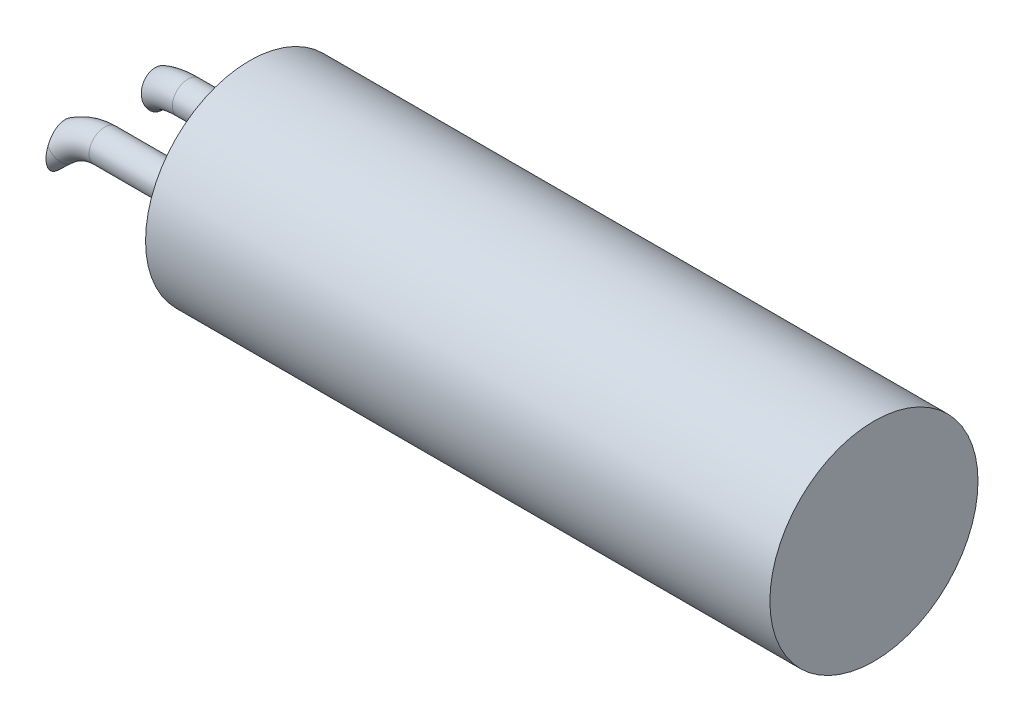
ISO-10303-21;
HEADER;
FILE_DESCRIPTION(('STEP AP214'),'2;1');
FILE_NAME('part.step','',(''),(''),'','','');
FILE_SCHEMA(('AUTOMOTIVE_DESIGN { 1 0 10303 214 1 1 1 1 }'));
ENDSEC;
DATA;
#1=APPLICATION_CONTEXT('core data for automotive mechanical design processes');
#2=APPLICATION_PROTOCOL_DEFINITION('international standard','automotive_design',2000,#1);
#3=PRODUCT_CONTEXT('',#1,'mechanical');
#4=PRODUCT('Part','Part','',(#3));
#5=PRODUCT_RELATED_PRODUCT_CATEGORY('part','',(#4));
#6=PRODUCT_DEFINITION_FORMATION('','',#4);
#7=PRODUCT_DEFINITION_CONTEXT('part definition',#1,'design');
#8=PRODUCT_DEFINITION('design','',#6,#7);
#9=PRODUCT_DEFINITION_SHAPE('','',#8);
#10=(LENGTH_UNIT() NAMED_UNIT(*) SI_UNIT(.MILLI.,.METRE.));
#11=(NAMED_UNIT(*) PLANE_ANGLE_UNIT() SI_UNIT($,.RADIAN.));
#12=(NAMED_UNIT(*) SI_UNIT($,.STERADIAN.) SOLID_ANGLE_UNIT());
#13=UNCERTAINTY_MEASURE_WITH_UNIT(LENGTH_MEASURE(1.E-05),#10,'distance_accuracy_value','');
#14=(GEOMETRIC_REPRESENTATION_CONTEXT(3) GLOBAL_UNCERTAINTY_ASSIGNED_CONTEXT((#13)) GLOBAL_UNIT_ASSIGNED_CONTEXT((#10,
#11,#12)) REPRESENTATION_CONTEXT('',''));
#15=CARTESIAN_POINT('',(0.,0.,0.));
#16=DIRECTION('',(0.,0.,1.));
#17=DIRECTION('',(1.,0.,0.));
#18=AXIS2_PLACEMENT_3D('',#15,#16,#17);
#19=CARTESIAN_POINT('',(-2.,5.9423211219704,-1.50030921711147));
#20=DIRECTION('',(-1.,0.,0.));
#21=DIRECTION('',(0.,-1.,0.));
#22=AXIS2_PLACEMENT_3D('',#19,#20,#21);
#23=PLANE('',#22);
#24=CARTESIAN_POINT('',(-2.,1.5,0.));
#25=DIRECTION('',(-1.,0.,0.));
#26=DIRECTION('',(0.,0.,1.));
#27=AXIS2_PLACEMENT_3D('',#24,#25,#26);
#28=CIRCLE('',#27,1.);
#29=CARTESIAN_POINT('',(-2.,1.5,1.));
#30=VERTEX_POINT('',#29);
#31=EDGE_CURVE('E82',#30,#30,#28,.T.);
#32=ORIENTED_EDGE('',*,*,#31,.F.);
#33=EDGE_LOOP('',(#32));
#34=FACE_BOUND('',#33,.T.);
#35=ADVANCED_FACE('F41',(#34),#23,.F.);
#36=CARTESIAN_POINT('',(-2.,1.5,0.));
#37=DIRECTION('',(-1.,0.,0.));
#38=DIRECTION('',(0.,0.,1.));
#39=AXIS2_PLACEMENT_3D('',#36,#37,#38);
#40=CYLINDRICAL_SURFACE('',#39,1.);
#41=ORIENTED_EDGE('',*,*,#31,.T.);
#42=EDGE_LOOP('',(#41));
#43=FACE_BOUND('',#42,.T.);
#44=CARTESIAN_POINT('',(-8.,1.5,0.));
#45=DIRECTION('',(-1.,0.,0.));
#46=DIRECTION('',(0.,0.,1.));
#47=AXIS2_PLACEMENT_3D('',#44,#45,#46);
#48=CIRCLE('',#47,1.);
#49=CARTESIAN_POINT('',(-8.,1.5,1.));
#50=VERTEX_POINT('',#49);
#51=EDGE_CURVE('E157',#50,#50,#48,.T.);
#52=ORIENTED_EDGE('',*,*,#51,.F.);
#53=EDGE_LOOP('',(#52));
#54=FACE_BOUND('',#53,.T.);
#55=ADVANCED_FACE('F139',(#43,#54),#40,.T.);
#56=CARTESIAN_POINT('',(-8.,1.5,0.));
#57=DIRECTION('',(1.,0.,0.));
#58=DIRECTION('',(0.,0.,-1.));
#59=AXIS2_PLACEMENT_3D('',#56,#57,#58);
#60=PLANE('',#59);
#61=CARTESIAN_POINT('',(-8.,1.5,0.4));
#62=DIRECTION('',(1.,0.,0.));
#63=DIRECTION('',(0.,1.,0.));
#64=AXIS2_PLACEMENT_3D('',#61,#62,#63);
#65=CIRCLE('',#64,0.15);
#66=CARTESIAN_POINT('',(-8.,1.65,0.4));
#67=VERTEX_POINT('',#66);
#68=EDGE_CURVE('E103',#67,#67,#65,.F.);
#69=ORIENTED_EDGE('',*,*,#68,.F.);
#70=EDGE_LOOP('',(#69));
#71=FACE_BOUND('',#70,.T.);
#72=CARTESIAN_POINT('',(-8.,1.5,-0.4));
#73=DIRECTION('',(1.,0.,0.));
#74=DIRECTION('',(0.,1.,0.));
#75=AXIS2_PLACEMENT_3D('',#72,#73,#74);
#76=CIRCLE('',#75,0.15);
#77=CARTESIAN_POINT('',(-8.,1.65,-0.4));
#78=VERTEX_POINT('',#77);
#79=EDGE_CURVE('E56',#78,#78,#76,.F.);
#80=ORIENTED_EDGE('',*,*,#79,.F.);
#81=EDGE_LOOP('',(#80));
#82=FACE_BOUND('',#81,.T.);
#83=ORIENTED_EDGE('',*,*,#51,.T.);
#84=EDGE_LOOP('',(#83));
#85=FACE_BOUND('',#84,.T.);
#86=ADVANCED_FACE('F144',(#71,#82,#85),#60,.F.);
#87=CARTESIAN_POINT('',(-9.34644660940673,1.36617539706785,0.459477601303177));
#88=DIRECTION('',(-0.707106781186545,-0.646162342755967,0.287183263447096));
#89=DIRECTION('',(0.674578520096278,-0.738203102286027,0.));
#90=AXIS2_PLACEMENT_3D('',#87,#88,#89);
#91=CYLINDRICAL_SURFACE('',#90,0.15);
#92=CARTESIAN_POINT('',(-9.33865218017504,1.37329803651468,0.456311983771255));
#93=DIRECTION('',(1.,0.,0.));
#94=DIRECTION('',(0.,-0.913811548620257,0.406138466053447));
#95=AXIS2_PLACEMENT_3D('',#92,#93,#94);
#96=ELLIPSE('',#95,0.212132034355966,0.15);
#97=CARTESIAN_POINT('',(-9.33865218017504,1.29829670493927,0.325942100301139));
#98=VERTEX_POINT('',#97);
#99=CARTESIAN_POINT('',(-9.33865218017504,1.41980881030279,0.599344337369057));
#100=VERTEX_POINT('',#99);
#101=EDGE_CURVE('E62',#98,#100,#96,.F.);
#102=ORIENTED_EDGE('',*,*,#101,.F.);
#103=CARTESIAN_POINT('',(-9.34644660940673,1.36617539706785,0.459477601303177));
#104=DIRECTION('',(-0.707106781186544,-0.646162342755967,0.287183263447096));
#105=DIRECTION('',(-0.707106781186551,0.646162342755962,-0.287183263447094));
#106=AXIS2_PLACEMENT_3D('',#103,#104,#105);
#107=CIRCLE('',#106,0.15);
#108=EDGE_CURVE('E88',#100,#98,#107,.F.);
#109=ORIENTED_EDGE('',*,*,#108,.F.);
#110=EDGE_LOOP('',(#102,#109));
#111=FACE_BOUND('',#110,.T.);
#112=ADVANCED_FACE('F43',(#111),#91,.T.);
#113=CARTESIAN_POINT('',(-9.34644660940673,1.36617539706785,-0.459477601303177));
#114=DIRECTION('',(-0.707106781186545,-0.646162342755967,-0.287183263447096));
#115=DIRECTION('',(0.674578520096278,-0.738203102286027,0.));
#116=AXIS2_PLACEMENT_3D('',#113,#114,#115);
#117=CYLINDRICAL_SURFACE('',#116,0.15);
#118=CARTESIAN_POINT('',(-9.33865218017504,1.37329803651468,-0.456311983771255));
#119=DIRECTION('',(1.,0.,0.));
#120=DIRECTION('',(0.,-0.913811548620257,-0.406138466053447));
#121=AXIS2_PLACEMENT_3D('',#118,#119,#120);
#122=ELLIPSE('',#121,0.212132034355966,0.15);
#123=CARTESIAN_POINT('',(-9.33865218017504,1.41980881030279,-0.599344337369058));
#124=VERTEX_POINT('',#123);
#125=CARTESIAN_POINT('',(-9.33865218017504,1.29829670493927,-0.325942100301141));
#126=VERTEX_POINT('',#125);
#127=EDGE_CURVE('E68',#124,#126,#122,.F.);
#128=ORIENTED_EDGE('',*,*,#127,.F.);
#129=CARTESIAN_POINT('',(-9.34644660940673,1.36617539706785,-0.459477601303177));
#130=DIRECTION('',(-0.707106781186544,-0.646162342755968,-0.287183263447096));
#131=DIRECTION('',(-0.707106781186551,0.646162342755961,0.287183263447094));
#132=AXIS2_PLACEMENT_3D('',#129,#130,#131);
#133=CIRCLE('',#132,0.15);
#134=EDGE_CURVE('E79',#126,#124,#133,.F.);
#135=ORIENTED_EDGE('',*,*,#134,.F.);
#136=EDGE_LOOP('',(#128,#135));
#137=FACE_BOUND('',#136,.T.);
#138=ADVANCED_FACE('F78',(#137),#117,.T.);
#139=CARTESIAN_POINT('',(-8.99289321881345,1.04309422568987,0.603069233026724));
#140=DIRECTION('',(0.,0.406138466053447,0.913811548620257));
#141=DIRECTION('',(0.,-0.913811548620257,0.406138466053447));
#142=AXIS2_PLACEMENT_3D('',#139,#140,#141);
#143=TOROIDAL_SURFACE('',#142,0.5,0.15);
#144=CARTESIAN_POINT('',(-9.33865218017504,1.41980881030279,0.599344337369057));
#145=CARTESIAN_POINT('',(-9.33865218017504,1.43157316977731,0.594826662663784));
#146=CARTESIAN_POINT('',(-9.33865218017504,1.44307532004661,0.589583979027131));
#147=CARTESIAN_POINT('',(-9.33865218017504,1.46530271629744,0.577456800797008));
#148=CARTESIAN_POINT('',(-9.33865218017504,1.47602021043632,0.57055822573458));
#149=CARTESIAN_POINT('',(-9.33865218017504,1.50295389923014,0.549801582843309));
#150=CARTESIAN_POINT('',(-9.33865218017504,1.5180553152464,0.53437429458602));
#151=CARTESIAN_POINT('',(-9.33865218017504,1.53990345295043,0.501970769790883));
#152=CARTESIAN_POINT('',(-9.33865218017504,1.54762305064194,0.485681047238925));
#153=CARTESIAN_POINT('',(-9.33865218017504,1.55455432007595,0.459942801090929));
#154=CARTESIAN_POINT('',(-9.33865218017504,1.5560856977152,0.451096887159833));
#155=CARTESIAN_POINT('',(-9.33865218017504,1.55740423330771,0.433268717834219));
#156=CARTESIAN_POINT('',(-9.33865218017504,1.55719270008103,0.424286569801898));
#157=CARTESIAN_POINT('',(-9.33865218017504,1.55508368201065,0.407706637740336));
#158=CARTESIAN_POINT('',(-9.33865218017504,1.55340837700617,0.400080374941327));
#159=CARTESIAN_POINT('',(-9.33865218017504,1.54870155267828,0.385256386097838));
#160=CARTESIAN_POINT('',(-9.33865218017504,1.54566893322539,0.378059013049641));
#161=CARTESIAN_POINT('',(-9.33865218017504,1.53520906938629,0.358535433913348));
#162=CARTESIAN_POINT('',(-9.33865218017504,1.52623235542958,0.347001122342675));
#163=CARTESIAN_POINT('',(-9.33865218017504,1.50499683043107,0.327315001097746));
#164=CARTESIAN_POINT('',(-9.33865218017504,1.4926990810029,0.319206453425031));
#165=CARTESIAN_POINT('',(-9.33865218017504,1.46521368713066,0.30635002238565));
#166=CARTESIAN_POINT('',(-9.33865218017504,1.44986895242092,0.301948172642158));
#167=CARTESIAN_POINT('',(-9.33865218017504,1.41631621029359,0.297043179008279));
#168=CARTESIAN_POINT('',(-9.33865218017504,1.39801909387635,0.297208918234936));
#169=CARTESIAN_POINT('',(-9.33865218017504,1.3657586701094,0.30153105472961));
#170=CARTESIAN_POINT('',(-9.33865218017504,1.35166423492577,0.304877633510659));
#171=CARTESIAN_POINT('',(-9.33865218017504,1.32431335372093,0.313849841040009));
#172=CARTESIAN_POINT('',(-9.33865218017504,1.31105188847335,0.319459915859286));
#173=CARTESIAN_POINT('',(-9.33865218017504,1.29829670493927,0.325942100301138));
#174=B_SPLINE_CURVE_WITH_KNOTS('',3,(#144,#145,#146,#147,#148,#149,#150,#151,#152,#153,#154,
#155,#156,#157,#158,#159,#160,#161,#162,#163,#164,#165,#166,#167,#168,#169,#170,#171,#172,#173),
.UNSPECIFIED.,.F.,.F.,(4,2,2,2,2,2,2,2,2,2,2,2,2,2,4),(0.,0.0377915199945497,0.075916545048645,
0.139532875584499,0.192548194302011,0.219334559706417,0.246100812013921,0.269396196619837,
0.29271049687235,0.335681064187395,0.379179140361023,0.426390998538786,0.480548943259747,
0.523807790367129,0.566774307787138),.UNSPECIFIED.);
#175=EDGE_CURVE('E81',#100,#98,#174,.T.);
#176=ORIENTED_EDGE('',*,*,#175,.F.);
#177=ORIENTED_EDGE('',*,*,#108,.T.);
#178=EDGE_LOOP('',(#176,#177));
#179=FACE_BOUND('',#178,.T.);
#180=CARTESIAN_POINT('',(-8.99289321881345,1.5,0.4));
#181=DIRECTION('',(1.,0.,0.));
#182=DIRECTION('',(0.,1.,0.));
#183=AXIS2_PLACEMENT_3D('',#180,#181,#182);
#184=CIRCLE('',#183,0.15);
#185=CARTESIAN_POINT('',(-8.99289321881345,1.65,0.4));
#186=VERTEX_POINT('',#185);
#187=EDGE_CURVE('E87',#186,#186,#184,.T.);
#188=ORIENTED_EDGE('',*,*,#187,.F.);
#189=EDGE_LOOP('',(#188));
#190=FACE_BOUND('',#189,.T.);
#191=ADVANCED_FACE('F122',(#179,#190),#143,.T.);
#192=CARTESIAN_POINT('',(-8.99289321881345,1.04309422568987,-0.603069233026724));
#193=DIRECTION('',(0.,-0.406138466053447,0.913811548620257));
#194=DIRECTION('',(0.,-0.913811548620257,-0.406138466053447));
#195=AXIS2_PLACEMENT_3D('',#192,#193,#194);
#196=TOROIDAL_SURFACE('',#195,0.5,0.15);
#197=CARTESIAN_POINT('',(-9.33865218017504,1.29829670493927,-0.32594210030114));
#198=CARTESIAN_POINT('',(-9.33865218017504,1.30953336416219,-0.320237100029774));
#199=CARTESIAN_POINT('',(-9.33865218017504,1.32113246714512,-0.315212559998768));
#200=CARTESIAN_POINT('',(-9.33865218017504,1.34502873094792,-0.30684033376061));
#201=CARTESIAN_POINT('',(-9.33865218017504,1.35733114871619,-0.303507836864306));
#202=CARTESIAN_POINT('',(-9.33865218017504,1.39078648953856,-0.297424911037265));
#203=CARTESIAN_POINT('',(-9.33865218017504,1.41235717815281,-0.296553486125442));
#204=CARTESIAN_POINT('',(-9.33865218017504,1.4510497836787,-0.302050013929498));
#205=CARTESIAN_POINT('',(-9.33865218017504,1.46831405041777,-0.307235796734538));
#206=CARTESIAN_POINT('',(-9.33865218017504,1.49206339305556,-0.31933821529506));
#207=CARTESIAN_POINT('',(-9.33865218017504,1.49965561315443,-0.324129196898106));
#208=CARTESIAN_POINT('',(-9.33865218017504,1.51377244825709,-0.335097201470314));
#209=CARTESIAN_POINT('',(-9.33865218017504,1.52029786061371,-0.34127318100044));
#210=CARTESIAN_POINT('',(-9.33865218017504,1.5311913547772,-0.353948901465061));
#211=CARTESIAN_POINT('',(-9.33865218017504,1.53572945886212,-0.360302809117209));
#212=CARTESIAN_POINT('',(-9.33865218017504,1.54357877448499,-0.373730135162932));
#213=CARTESIAN_POINT('',(-9.33865218017504,1.54688898680491,-0.380804133603557));
#214=CARTESIAN_POINT('',(-9.33865218017504,1.55437152853967,-0.401650967008447));
#215=CARTESIAN_POINT('',(-9.33865218017504,1.55691775561083,-0.416043272750476));
#216=CARTESIAN_POINT('',(-9.33865218017504,1.55730014328847,-0.444997455026904));
#217=CARTESIAN_POINT('',(-9.33865218017504,1.55507809916068,-0.459559244280042));
#218=CARTESIAN_POINT('',(-9.33865218017504,1.54620296960542,-0.48857590795387));
#219=CARTESIAN_POINT('',(-9.33865218017504,1.5391877678054,-0.502915507257254));
#220=CARTESIAN_POINT('',(-9.33865218017504,1.52034479155142,-0.531107486838381));
#221=CARTESIAN_POINT('',(-9.33865218017504,1.50796081432008,-0.544577789233315));
#222=CARTESIAN_POINT('',(-9.33865218017504,1.48313482078948,-0.565627393759778));
#223=CARTESIAN_POINT('',(-9.33865218017504,1.47120603770523,-0.573846689764455));
#224=CARTESIAN_POINT('',(-9.33865218017504,1.44621834471113,-0.588136070767967));
#225=CARTESIAN_POINT('',(-9.33865218017504,1.43316761658659,-0.594220304114073));
#226=CARTESIAN_POINT('',(-9.33865218017504,1.41980881030279,-0.599344337369058));
#227=B_SPLINE_CURVE_WITH_KNOTS('',3,(#197,#198,#199,#200,#201,#202,#203,#204,#205,#206,#207,
#208,#209,#210,#211,#212,#213,#214,#215,#216,#217,#218,#219,#220,#221,#222,#223,#224,#225,#226),
.UNSPECIFIED.,.F.,.F.,(4,2,2,2,2,2,2,2,2,2,2,2,2,2,4),(0.,0.0377915199945499,0.075916545048645,
0.139532875584499,0.192548194302012,0.219334559706418,0.246100812013923,0.269396196619839,
0.292710496872352,0.335681064187398,0.379179140361025,0.426390998538789,0.480548943259749,
0.523807790367134,0.566774307787147),.UNSPECIFIED.);
#228=EDGE_CURVE('E11',#126,#124,#227,.T.);
#229=ORIENTED_EDGE('',*,*,#228,.F.);
#230=ORIENTED_EDGE('',*,*,#134,.T.);
#231=EDGE_LOOP('',(#229,#230));
#232=FACE_BOUND('',#231,.T.);
#233=CARTESIAN_POINT('',(-8.99289321881345,1.5,-0.4));
#234=DIRECTION('',(1.,0.,0.));
#235=DIRECTION('',(0.,1.,0.));
#236=AXIS2_PLACEMENT_3D('',#233,#234,#235);
#237=CIRCLE('',#236,0.15);
#238=CARTESIAN_POINT('',(-8.99289321881345,1.65,-0.4));
#239=VERTEX_POINT('',#238);
#240=EDGE_CURVE('E93',#239,#239,#237,.T.);
#241=ORIENTED_EDGE('',*,*,#240,.F.);
#242=EDGE_LOOP('',(#241));
#243=FACE_BOUND('',#242,.T.);
#244=ADVANCED_FACE('F84',(#232,#243),#196,.T.);
#245=CARTESIAN_POINT('',(-8.99289321881345,1.5,0.4));
#246=DIRECTION('',(1.,0.,0.));
#247=DIRECTION('',(0.,1.,0.));
#248=AXIS2_PLACEMENT_3D('',#245,#246,#247);
#249=CYLINDRICAL_SURFACE('',#248,0.15);
#250=ORIENTED_EDGE('',*,*,#68,.T.);
#251=EDGE_LOOP('',(#250));
#252=FACE_BOUND('',#251,.T.);
#253=ORIENTED_EDGE('',*,*,#187,.T.);
#254=EDGE_LOOP('',(#253));
#255=FACE_BOUND('',#254,.T.);
#256=ADVANCED_FACE('F121',(#252,#255),#249,.T.);
#257=CARTESIAN_POINT('',(-8.99289321881345,1.5,-0.4));
#258=DIRECTION('',(1.,0.,0.));
#259=DIRECTION('',(0.,1.,0.));
#260=AXIS2_PLACEMENT_3D('',#257,#258,#259);
#261=CYLINDRICAL_SURFACE('',#260,0.15);
#262=ORIENTED_EDGE('',*,*,#240,.T.);
#263=EDGE_LOOP('',(#262));
#264=FACE_BOUND('',#263,.T.);
#265=ORIENTED_EDGE('',*,*,#79,.T.);
#266=EDGE_LOOP('',(#265));
#267=FACE_BOUND('',#266,.T.);
#268=ADVANCED_FACE('F138',(#264,#267),#261,.T.);
#269=CARTESIAN_POINT('',(-9.33865218017504,-0.0206347812907272,-6.60642554380715));
#270=DIRECTION('',(1.,0.,0.));
#271=DIRECTION('',(0.,0.,-1.));
#272=AXIS2_PLACEMENT_3D('',#269,#270,#271);
#273=PLANE('',#272);
#274=ORIENTED_EDGE('',*,*,#127,.T.);
#275=ORIENTED_EDGE('',*,*,#228,.T.);
#276=EDGE_LOOP('',(#274,#275));
#277=FACE_BOUND('',#276,.T.);
#278=ADVANCED_FACE('F73',(#277),#273,.F.);
#279=ORIENTED_EDGE('',*,*,#101,.T.);
#280=ORIENTED_EDGE('',*,*,#175,.T.);
#281=EDGE_LOOP('',(#279,#280));
#282=FACE_BOUND('',#281,.T.);
#283=ADVANCED_FACE('F137',(#282),#273,.F.);
#284=CLOSED_SHELL('',(#35,#55,#86,#112,#138,#191,#244,#256,#268,#278,#283));
#285=MANIFOLD_SOLID_BREP('B2',#284);
#286=ADVANCED_BREP_SHAPE_REPRESENTATION('',(#18,#285),#14);
#287=SHAPE_DEFINITION_REPRESENTATION(#9,#286);
ENDSEC;
END-ISO-10303-21;
